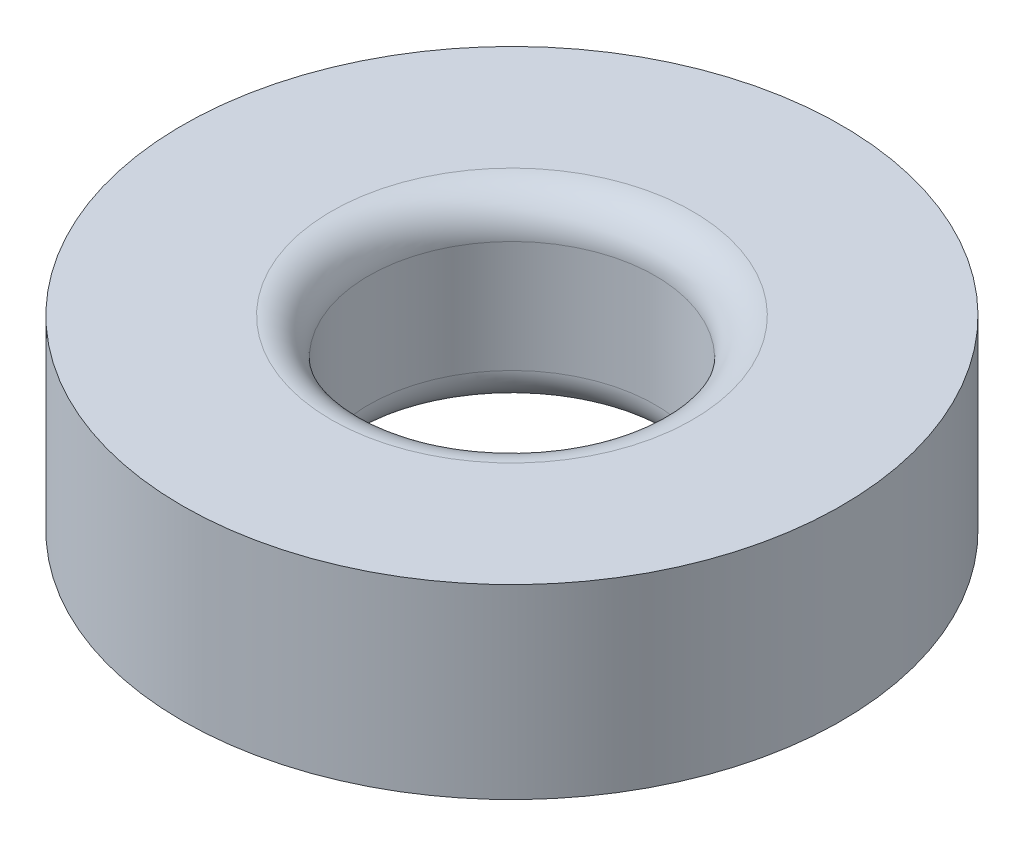
ISO-10303-21;
HEADER;
FILE_DESCRIPTION(('STEP AP214'),'2;1');
FILE_NAME('part.step','',(''),(''),'','','');
FILE_SCHEMA(('AUTOMOTIVE_DESIGN { 1 0 10303 214 1 1 1 1 }'));
ENDSEC;
DATA;
#1=APPLICATION_CONTEXT('core data for automotive mechanical design processes');
#2=APPLICATION_PROTOCOL_DEFINITION('international standard','automotive_design',2000,#1);
#3=PRODUCT_CONTEXT('',#1,'mechanical');
#4=PRODUCT('Part','Part','',(#3));
#5=PRODUCT_RELATED_PRODUCT_CATEGORY('part','',(#4));
#6=PRODUCT_DEFINITION_FORMATION('','',#4);
#7=PRODUCT_DEFINITION_CONTEXT('part definition',#1,'design');
#8=PRODUCT_DEFINITION('design','',#6,#7);
#9=PRODUCT_DEFINITION_SHAPE('','',#8);
#10=(LENGTH_UNIT() NAMED_UNIT(*) SI_UNIT(.MILLI.,.METRE.));
#11=(NAMED_UNIT(*) PLANE_ANGLE_UNIT() SI_UNIT($,.RADIAN.));
#12=(NAMED_UNIT(*) SI_UNIT($,.STERADIAN.) SOLID_ANGLE_UNIT());
#13=UNCERTAINTY_MEASURE_WITH_UNIT(LENGTH_MEASURE(1.E-05),#10,'distance_accuracy_value','');
#14=(GEOMETRIC_REPRESENTATION_CONTEXT(3) GLOBAL_UNCERTAINTY_ASSIGNED_CONTEXT((#13)) GLOBAL_UNIT_ASSIGNED_CONTEXT((#10,
#11,#12)) REPRESENTATION_CONTEXT('',''));
#15=CARTESIAN_POINT('',(0.,0.,0.));
#16=DIRECTION('',(0.,0.,1.));
#17=DIRECTION('',(1.,0.,0.));
#18=AXIS2_PLACEMENT_3D('',#15,#16,#17);
#19=CARTESIAN_POINT('',(0.,5.,0.));
#20=DIRECTION('',(0.,1.,0.));
#21=DIRECTION('',(0.,0.,1.));
#22=AXIS2_PLACEMENT_3D('',#19,#20,#21);
#23=PLANE('',#22);
#24=CARTESIAN_POINT('',(0.,5.,0.));
#25=DIRECTION('',(0.,1.,0.));
#26=DIRECTION('',(0.,0.,1.));
#27=AXIS2_PLACEMENT_3D('',#24,#25,#26);
#28=CIRCLE('',#27,4.85);
#29=CARTESIAN_POINT('',(0.,5.,4.85));
#30=VERTEX_POINT('',#29);
#31=EDGE_CURVE('E10',#30,#30,#28,.F.);
#32=ORIENTED_EDGE('',*,*,#31,.T.);
#33=EDGE_LOOP('',(#32));
#34=FACE_BOUND('',#33,.T.);
#35=CARTESIAN_POINT('',(0.,5.,0.));
#36=DIRECTION('',(0.,1.,0.));
#37=DIRECTION('',(0.,0.,1.));
#38=AXIS2_PLACEMENT_3D('',#35,#36,#37);
#39=CIRCLE('',#38,8.85);
#40=CARTESIAN_POINT('',(0.,5.,8.85));
#41=VERTEX_POINT('',#40);
#42=EDGE_CURVE('E67',#41,#41,#39,.T.);
#43=ORIENTED_EDGE('',*,*,#42,.T.);
#44=EDGE_LOOP('',(#43));
#45=FACE_BOUND('',#44,.T.);
#46=ADVANCED_FACE('F43',(#34,#45),#23,.T.);
#47=CARTESIAN_POINT('',(0.,0.,0.));
#48=DIRECTION('',(0.,1.,0.));
#49=DIRECTION('',(0.,0.,1.));
#50=AXIS2_PLACEMENT_3D('',#47,#48,#49);
#51=PLANE('',#50);
#52=CARTESIAN_POINT('',(0.,0.,0.));
#53=DIRECTION('',(0.,1.,0.));
#54=DIRECTION('',(0.,0.,1.));
#55=AXIS2_PLACEMENT_3D('',#52,#53,#54);
#56=CIRCLE('',#55,4.85);
#57=CARTESIAN_POINT('',(0.,0.,4.85));
#58=VERTEX_POINT('',#57);
#59=EDGE_CURVE('E61',#58,#58,#56,.T.);
#60=ORIENTED_EDGE('',*,*,#59,.T.);
#61=EDGE_LOOP('',(#60));
#62=FACE_BOUND('',#61,.T.);
#63=CARTESIAN_POINT('',(0.,0.,0.));
#64=DIRECTION('',(0.,1.,0.));
#65=DIRECTION('',(0.,0.,1.));
#66=AXIS2_PLACEMENT_3D('',#63,#64,#65);
#67=CIRCLE('',#66,8.85);
#68=CARTESIAN_POINT('',(0.,0.,8.85));
#69=VERTEX_POINT('',#68);
#70=EDGE_CURVE('E68',#69,#69,#67,.T.);
#71=ORIENTED_EDGE('',*,*,#70,.F.);
#72=EDGE_LOOP('',(#71));
#73=FACE_BOUND('',#72,.T.);
#74=ADVANCED_FACE('F81',(#62,#73),#51,.F.);
#75=CARTESIAN_POINT('',(0.,5.,0.));
#76=DIRECTION('',(0.,-1.,0.));
#77=DIRECTION('',(0.,0.,-1.));
#78=AXIS2_PLACEMENT_3D('',#75,#76,#77);
#79=CYLINDRICAL_SURFACE('',#78,8.85);
#80=ORIENTED_EDGE('',*,*,#42,.F.);
#81=EDGE_LOOP('',(#80));
#82=FACE_BOUND('',#81,.T.);
#83=ORIENTED_EDGE('',*,*,#70,.T.);
#84=EDGE_LOOP('',(#83));
#85=FACE_BOUND('',#84,.T.);
#86=ADVANCED_FACE('F77',(#82,#85),#79,.T.);
#87=CARTESIAN_POINT('',(0.,5.,0.));
#88=DIRECTION('',(0.,-1.,0.));
#89=DIRECTION('',(0.,0.,-1.));
#90=AXIS2_PLACEMENT_3D('',#87,#88,#89);
#91=CYLINDRICAL_SURFACE('',#90,3.85);
#92=CARTESIAN_POINT('',(0.,1.,0.));
#93=DIRECTION('',(0.,1.,0.));
#94=DIRECTION('',(0.,0.,1.));
#95=AXIS2_PLACEMENT_3D('',#92,#93,#94);
#96=CIRCLE('',#95,3.85);
#97=CARTESIAN_POINT('',(0.,1.,3.85));
#98=VERTEX_POINT('',#97);
#99=EDGE_CURVE('E51',#98,#98,#96,.F.);
#100=ORIENTED_EDGE('',*,*,#99,.T.);
#101=EDGE_LOOP('',(#100));
#102=FACE_BOUND('',#101,.T.);
#103=CARTESIAN_POINT('',(0.,4.,0.));
#104=DIRECTION('',(0.,1.,0.));
#105=DIRECTION('',(0.,0.,1.));
#106=AXIS2_PLACEMENT_3D('',#103,#104,#105);
#107=CIRCLE('',#106,3.85);
#108=CARTESIAN_POINT('',(0.,4.,3.85));
#109=VERTEX_POINT('',#108);
#110=EDGE_CURVE('E56',#109,#109,#107,.T.);
#111=ORIENTED_EDGE('',*,*,#110,.T.);
#112=EDGE_LOOP('',(#111));
#113=FACE_BOUND('',#112,.T.);
#114=ADVANCED_FACE('F80',(#102,#113),#91,.F.);
#115=CARTESIAN_POINT('',(0.,1.,0.));
#116=DIRECTION('',(0.,1.,0.));
#117=DIRECTION('',(0.,0.,1.));
#118=AXIS2_PLACEMENT_3D('',#115,#116,#117);
#119=TOROIDAL_SURFACE('',#118,4.85,1.);
#120=ORIENTED_EDGE('',*,*,#99,.F.);
#121=EDGE_LOOP('',(#120));
#122=FACE_BOUND('',#121,.T.);
#123=ORIENTED_EDGE('',*,*,#59,.F.);
#124=EDGE_LOOP('',(#123));
#125=FACE_BOUND('',#124,.T.);
#126=ADVANCED_FACE('F94',(#122,#125),#119,.T.);
#127=CARTESIAN_POINT('',(0.,4.,0.));
#128=DIRECTION('',(0.,1.,0.));
#129=DIRECTION('',(0.,0.,1.));
#130=AXIS2_PLACEMENT_3D('',#127,#128,#129);
#131=TOROIDAL_SURFACE('',#130,4.85,1.);
#132=ORIENTED_EDGE('',*,*,#31,.F.);
#133=EDGE_LOOP('',(#132));
#134=FACE_BOUND('',#133,.T.);
#135=ORIENTED_EDGE('',*,*,#110,.F.);
#136=EDGE_LOOP('',(#135));
#137=FACE_BOUND('',#136,.T.);
#138=ADVANCED_FACE('F45',(#134,#137),#131,.T.);
#139=CLOSED_SHELL('',(#46,#74,#86,#114,#126,#138));
#140=MANIFOLD_SOLID_BREP('B2',#139);
#141=ADVANCED_BREP_SHAPE_REPRESENTATION('',(#18,#140),#14);
#142=SHAPE_DEFINITION_REPRESENTATION(#9,#141);
ENDSEC;
END-ISO-10303-21;
